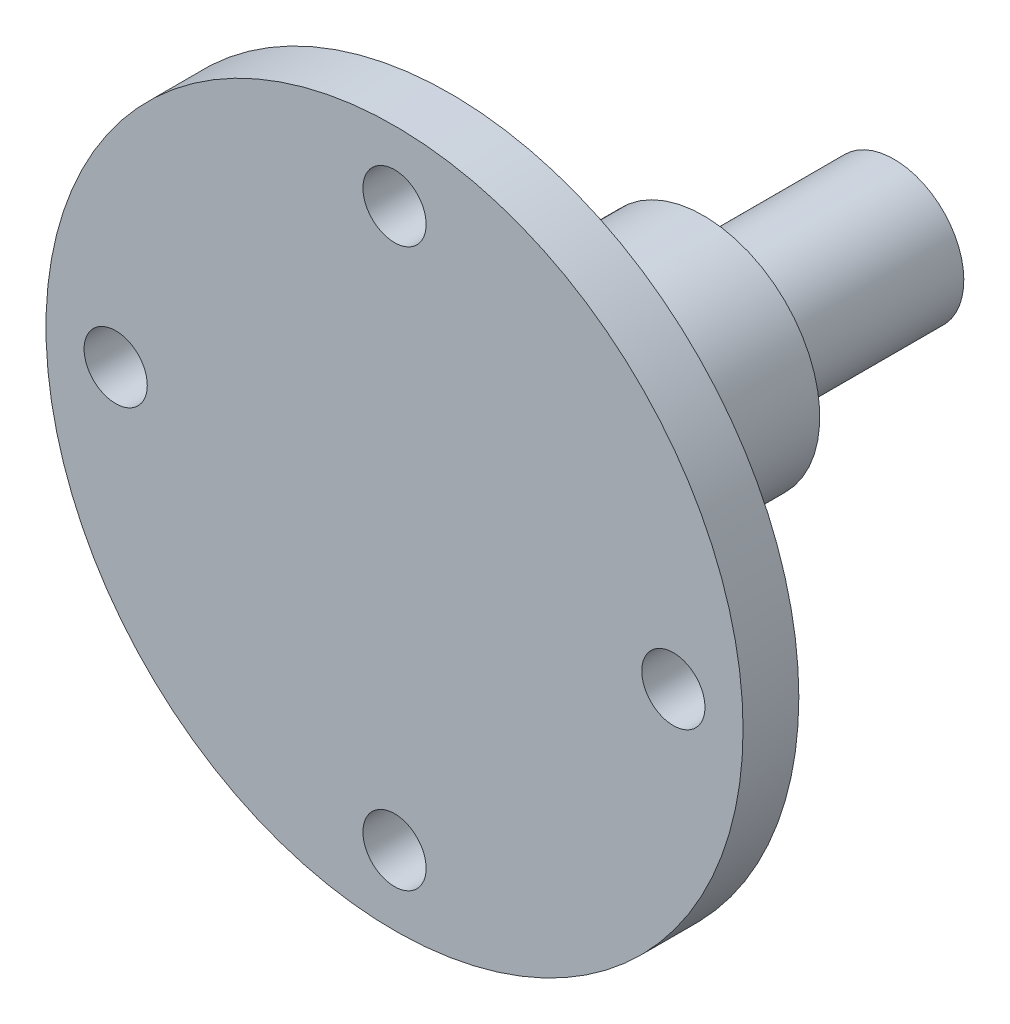
ISO-10303-21;
HEADER;
FILE_DESCRIPTION(('STEP AP214'),'2;1');
FILE_NAME('part.step','',(''),(''),'','','');
FILE_SCHEMA(('AUTOMOTIVE_DESIGN { 1 0 10303 214 1 1 1 1 }'));
ENDSEC;
DATA;
#1=APPLICATION_CONTEXT('core data for automotive mechanical design processes');
#2=APPLICATION_PROTOCOL_DEFINITION('international standard','automotive_design',2000,#1);
#3=PRODUCT_CONTEXT('',#1,'mechanical');
#4=PRODUCT('Part','Part','',(#3));
#5=PRODUCT_RELATED_PRODUCT_CATEGORY('part','',(#4));
#6=PRODUCT_DEFINITION_FORMATION('','',#4);
#7=PRODUCT_DEFINITION_CONTEXT('part definition',#1,'design');
#8=PRODUCT_DEFINITION('design','',#6,#7);
#9=PRODUCT_DEFINITION_SHAPE('','',#8);
#10=(LENGTH_UNIT() NAMED_UNIT(*) SI_UNIT(.MILLI.,.METRE.));
#11=(NAMED_UNIT(*) PLANE_ANGLE_UNIT() SI_UNIT($,.RADIAN.));
#12=(NAMED_UNIT(*) SI_UNIT($,.STERADIAN.) SOLID_ANGLE_UNIT());
#13=UNCERTAINTY_MEASURE_WITH_UNIT(LENGTH_MEASURE(1.E-05),#10,'distance_accuracy_value','');
#14=(GEOMETRIC_REPRESENTATION_CONTEXT(3) GLOBAL_UNCERTAINTY_ASSIGNED_CONTEXT((#13)) GLOBAL_UNIT_ASSIGNED_CONTEXT((#10,
#11,#12)) REPRESENTATION_CONTEXT('',''));
#15=CARTESIAN_POINT('',(0.,0.,0.));
#16=DIRECTION('',(0.,0.,1.));
#17=DIRECTION('',(1.,0.,0.));
#18=AXIS2_PLACEMENT_3D('',#15,#16,#17);
#19=CARTESIAN_POINT('',(0.,0.,6.));
#20=DIRECTION('',(0.,0.,-1.));
#21=DIRECTION('',(-1.,0.,0.));
#22=AXIS2_PLACEMENT_3D('',#19,#20,#21);
#23=CYLINDRICAL_SURFACE('',#22,37.5);
#24=CARTESIAN_POINT('',(0.,0.,6.));
#25=DIRECTION('',(0.,0.,1.));
#26=DIRECTION('',(1.,0.,0.));
#27=AXIS2_PLACEMENT_3D('',#24,#25,#26);
#28=CIRCLE('',#27,37.5);
#29=CARTESIAN_POINT('',(37.5,0.,6.));
#30=VERTEX_POINT('',#29);
#31=EDGE_CURVE('E153',#30,#30,#28,.T.);
#32=ORIENTED_EDGE('',*,*,#31,.F.);
#33=EDGE_LOOP('',(#32));
#34=FACE_BOUND('',#33,.T.);
#35=CARTESIAN_POINT('',(0.,0.,0.));
#36=DIRECTION('',(0.,0.,1.));
#37=DIRECTION('',(1.,0.,0.));
#38=AXIS2_PLACEMENT_3D('',#35,#36,#37);
#39=CIRCLE('',#38,37.5);
#40=CARTESIAN_POINT('',(37.5,0.,0.));
#41=VERTEX_POINT('',#40);
#42=EDGE_CURVE('E152',#41,#41,#39,.T.);
#43=ORIENTED_EDGE('',*,*,#42,.T.);
#44=EDGE_LOOP('',(#43));
#45=FACE_BOUND('',#44,.T.);
#46=ADVANCED_FACE('F34',(#34,#45),#23,.T.);
#47=CARTESIAN_POINT('',(0.,0.,6.));
#48=DIRECTION('',(0.,0.,1.));
#49=DIRECTION('',(1.,0.,0.));
#50=AXIS2_PLACEMENT_3D('',#47,#48,#49);
#51=PLANE('',#50);
#52=CARTESIAN_POINT('',(0.,30.,6.));
#53=DIRECTION('',(0.,0.,1.));
#54=DIRECTION('',(1.,0.,0.));
#55=AXIS2_PLACEMENT_3D('',#52,#53,#54);
#56=CIRCLE('',#55,3.4);
#57=CARTESIAN_POINT('',(3.4,30.,6.));
#58=VERTEX_POINT('',#57);
#59=EDGE_CURVE('E130',#58,#58,#56,.T.);
#60=ORIENTED_EDGE('',*,*,#59,.F.);
#61=EDGE_LOOP('',(#60));
#62=FACE_BOUND('',#61,.T.);
#63=CARTESIAN_POINT('',(30.,0.,6.));
#64=DIRECTION('',(0.,0.,1.));
#65=DIRECTION('',(1.,0.,0.));
#66=AXIS2_PLACEMENT_3D('',#63,#64,#65);
#67=CIRCLE('',#66,3.39999999999999);
#68=CARTESIAN_POINT('',(33.4,0.,6.));
#69=VERTEX_POINT('',#68);
#70=EDGE_CURVE('E136',#69,#69,#67,.T.);
#71=ORIENTED_EDGE('',*,*,#70,.F.);
#72=EDGE_LOOP('',(#71));
#73=FACE_BOUND('',#72,.T.);
#74=CARTESIAN_POINT('',(0.,-30.,6.));
#75=DIRECTION('',(0.,0.,1.));
#76=DIRECTION('',(1.,0.,0.));
#77=AXIS2_PLACEMENT_3D('',#74,#75,#76);
#78=CIRCLE('',#77,3.4);
#79=CARTESIAN_POINT('',(3.4,-30.,6.));
#80=VERTEX_POINT('',#79);
#81=EDGE_CURVE('E140',#80,#80,#78,.T.);
#82=ORIENTED_EDGE('',*,*,#81,.F.);
#83=EDGE_LOOP('',(#82));
#84=FACE_BOUND('',#83,.T.);
#85=CARTESIAN_POINT('',(-30.,0.,6.));
#86=DIRECTION('',(0.,0.,1.));
#87=DIRECTION('',(1.,0.,0.));
#88=AXIS2_PLACEMENT_3D('',#85,#86,#87);
#89=CIRCLE('',#88,3.4);
#90=CARTESIAN_POINT('',(-26.6,0.,6.));
#91=VERTEX_POINT('',#90);
#92=EDGE_CURVE('E146',#91,#91,#89,.T.);
#93=ORIENTED_EDGE('',*,*,#92,.F.);
#94=EDGE_LOOP('',(#93));
#95=FACE_BOUND('',#94,.T.);
#96=ORIENTED_EDGE('',*,*,#31,.T.);
#97=EDGE_LOOP('',(#96));
#98=FACE_BOUND('',#97,.T.);
#99=ADVANCED_FACE('F190',(#62,#73,#84,#95,#98),#51,.T.);
#100=CARTESIAN_POINT('',(0.,0.,0.));
#101=DIRECTION('',(0.,0.,1.));
#102=DIRECTION('',(1.,0.,0.));
#103=AXIS2_PLACEMENT_3D('',#100,#101,#102);
#104=PLANE('',#103);
#105=CARTESIAN_POINT('',(0.,0.,0.));
#106=DIRECTION('',(0.,0.,1.));
#107=DIRECTION('',(1.,0.,0.));
#108=AXIS2_PLACEMENT_3D('',#105,#106,#107);
#109=CIRCLE('',#108,14.5);
#110=CARTESIAN_POINT('',(14.5,0.,0.));
#111=VERTEX_POINT('',#110);
#112=EDGE_CURVE('E127',#111,#111,#109,.F.);
#113=ORIENTED_EDGE('',*,*,#112,.F.);
#114=EDGE_LOOP('',(#113));
#115=FACE_BOUND('',#114,.T.);
#116=CARTESIAN_POINT('',(0.,30.,0.));
#117=DIRECTION('',(0.,0.,1.));
#118=DIRECTION('',(1.,0.,0.));
#119=AXIS2_PLACEMENT_3D('',#116,#117,#118);
#120=CIRCLE('',#119,3.4);
#121=CARTESIAN_POINT('',(3.4,30.,0.));
#122=VERTEX_POINT('',#121);
#123=EDGE_CURVE('E133',#122,#122,#120,.T.);
#124=ORIENTED_EDGE('',*,*,#123,.T.);
#125=EDGE_LOOP('',(#124));
#126=FACE_BOUND('',#125,.T.);
#127=CARTESIAN_POINT('',(30.,0.,0.));
#128=DIRECTION('',(0.,0.,1.));
#129=DIRECTION('',(1.,0.,0.));
#130=AXIS2_PLACEMENT_3D('',#127,#128,#129);
#131=CIRCLE('',#130,3.39999999999999);
#132=CARTESIAN_POINT('',(33.4,0.,0.));
#133=VERTEX_POINT('',#132);
#134=EDGE_CURVE('E139',#133,#133,#131,.T.);
#135=ORIENTED_EDGE('',*,*,#134,.T.);
#136=EDGE_LOOP('',(#135));
#137=FACE_BOUND('',#136,.T.);
#138=CARTESIAN_POINT('',(0.,-30.,0.));
#139=DIRECTION('',(0.,0.,1.));
#140=DIRECTION('',(1.,0.,0.));
#141=AXIS2_PLACEMENT_3D('',#138,#139,#140);
#142=CIRCLE('',#141,3.4);
#143=CARTESIAN_POINT('',(3.4,-30.,0.));
#144=VERTEX_POINT('',#143);
#145=EDGE_CURVE('E143',#144,#144,#142,.T.);
#146=ORIENTED_EDGE('',*,*,#145,.T.);
#147=EDGE_LOOP('',(#146));
#148=FACE_BOUND('',#147,.T.);
#149=CARTESIAN_POINT('',(-30.,0.,0.));
#150=DIRECTION('',(0.,0.,1.));
#151=DIRECTION('',(1.,0.,0.));
#152=AXIS2_PLACEMENT_3D('',#149,#150,#151);
#153=CIRCLE('',#152,3.4);
#154=CARTESIAN_POINT('',(-26.6,0.,0.));
#155=VERTEX_POINT('',#154);
#156=EDGE_CURVE('E149',#155,#155,#153,.T.);
#157=ORIENTED_EDGE('',*,*,#156,.T.);
#158=EDGE_LOOP('',(#157));
#159=FACE_BOUND('',#158,.T.);
#160=ORIENTED_EDGE('',*,*,#42,.F.);
#161=EDGE_LOOP('',(#160));
#162=FACE_BOUND('',#161,.T.);
#163=ADVANCED_FACE('F195',(#115,#126,#137,#148,#159,#162),#104,.F.);
#164=CARTESIAN_POINT('',(-30.,0.,6.));
#165=DIRECTION('',(0.,0.,1.));
#166=DIRECTION('',(1.,0.,0.));
#167=AXIS2_PLACEMENT_3D('',#164,#165,#166);
#168=CYLINDRICAL_SURFACE('',#167,3.4);
#169=ORIENTED_EDGE('',*,*,#92,.T.);
#170=EDGE_LOOP('',(#169));
#171=FACE_BOUND('',#170,.T.);
#172=ORIENTED_EDGE('',*,*,#156,.F.);
#173=EDGE_LOOP('',(#172));
#174=FACE_BOUND('',#173,.T.);
#175=ADVANCED_FACE('F203',(#171,#174),#168,.F.);
#176=CARTESIAN_POINT('',(0.,-30.,6.));
#177=DIRECTION('',(0.,0.,1.));
#178=DIRECTION('',(1.,0.,0.));
#179=AXIS2_PLACEMENT_3D('',#176,#177,#178);
#180=CYLINDRICAL_SURFACE('',#179,3.4);
#181=ORIENTED_EDGE('',*,*,#81,.T.);
#182=EDGE_LOOP('',(#181));
#183=FACE_BOUND('',#182,.T.);
#184=ORIENTED_EDGE('',*,*,#145,.F.);
#185=EDGE_LOOP('',(#184));
#186=FACE_BOUND('',#185,.T.);
#187=ADVANCED_FACE('F208',(#183,#186),#180,.F.);
#188=CARTESIAN_POINT('',(30.,0.,6.));
#189=DIRECTION('',(0.,0.,1.));
#190=DIRECTION('',(1.,0.,0.));
#191=AXIS2_PLACEMENT_3D('',#188,#189,#190);
#192=CYLINDRICAL_SURFACE('',#191,3.39999999999999);
#193=ORIENTED_EDGE('',*,*,#70,.T.);
#194=EDGE_LOOP('',(#193));
#195=FACE_BOUND('',#194,.T.);
#196=ORIENTED_EDGE('',*,*,#134,.F.);
#197=EDGE_LOOP('',(#196));
#198=FACE_BOUND('',#197,.T.);
#199=ADVANCED_FACE('F216',(#195,#198),#192,.F.);
#200=CARTESIAN_POINT('',(0.,30.,6.));
#201=DIRECTION('',(0.,0.,1.));
#202=DIRECTION('',(1.,0.,0.));
#203=AXIS2_PLACEMENT_3D('',#200,#201,#202);
#204=CYLINDRICAL_SURFACE('',#203,3.4);
#205=ORIENTED_EDGE('',*,*,#59,.T.);
#206=EDGE_LOOP('',(#205));
#207=FACE_BOUND('',#206,.T.);
#208=ORIENTED_EDGE('',*,*,#123,.F.);
#209=EDGE_LOOP('',(#208));
#210=FACE_BOUND('',#209,.T.);
#211=ADVANCED_FACE('F220',(#207,#210),#204,.F.);
#212=CARTESIAN_POINT('',(0.,0.,-6.));
#213=DIRECTION('',(0.,0.,1.));
#214=DIRECTION('',(1.,0.,0.));
#215=AXIS2_PLACEMENT_3D('',#212,#213,#214);
#216=CYLINDRICAL_SURFACE('',#215,14.5);
#217=CARTESIAN_POINT('',(0.,0.,-6.));
#218=DIRECTION('',(0.,0.,-1.));
#219=DIRECTION('',(-1.,0.,0.));
#220=AXIS2_PLACEMENT_3D('',#217,#218,#219);
#221=CIRCLE('',#220,14.5);
#222=CARTESIAN_POINT('',(-14.5,0.,-6.));
#223=VERTEX_POINT('',#222);
#224=EDGE_CURVE('E124',#223,#223,#221,.T.);
#225=ORIENTED_EDGE('',*,*,#224,.F.);
#226=EDGE_LOOP('',(#225));
#227=FACE_BOUND('',#226,.T.);
#228=ORIENTED_EDGE('',*,*,#112,.T.);
#229=EDGE_LOOP('',(#228));
#230=FACE_BOUND('',#229,.T.);
#231=ADVANCED_FACE('F224',(#227,#230),#216,.T.);
#232=CARTESIAN_POINT('',(0.,0.,-6.));
#233=DIRECTION('',(0.,0.,-1.));
#234=DIRECTION('',(-1.,0.,0.));
#235=AXIS2_PLACEMENT_3D('',#232,#233,#234);
#236=PLANE('',#235);
#237=CARTESIAN_POINT('',(0.,0.,-6.));
#238=DIRECTION('',(0.,0.,-1.));
#239=DIRECTION('',(-1.,0.,0.));
#240=AXIS2_PLACEMENT_3D('',#237,#238,#239);
#241=CIRCLE('',#240,12.5);
#242=CARTESIAN_POINT('',(-12.5,0.,-6.));
#243=VERTEX_POINT('',#242);
#244=EDGE_CURVE('E121',#243,#243,#241,.T.);
#245=ORIENTED_EDGE('',*,*,#244,.F.);
#246=EDGE_LOOP('',(#245));
#247=FACE_BOUND('',#246,.T.);
#248=ORIENTED_EDGE('',*,*,#224,.T.);
#249=EDGE_LOOP('',(#248));
#250=FACE_BOUND('',#249,.T.);
#251=ADVANCED_FACE('F228',(#247,#250),#236,.T.);
#252=CARTESIAN_POINT('',(0.,0.,-27.25));
#253=DIRECTION('',(0.,0.,1.));
#254=DIRECTION('',(1.,0.,0.));
#255=AXIS2_PLACEMENT_3D('',#252,#253,#254);
#256=CYLINDRICAL_SURFACE('',#255,12.5);
#257=CARTESIAN_POINT('',(0.,0.,-27.25));
#258=DIRECTION('',(0.,0.,-1.));
#259=DIRECTION('',(-1.,0.,0.));
#260=AXIS2_PLACEMENT_3D('',#257,#258,#259);
#261=CIRCLE('',#260,12.5);
#262=CARTESIAN_POINT('',(-12.5,0.,-27.25));
#263=VERTEX_POINT('',#262);
#264=EDGE_CURVE('E116',#263,#263,#261,.T.);
#265=ORIENTED_EDGE('',*,*,#264,.F.);
#266=EDGE_LOOP('',(#265));
#267=FACE_BOUND('',#266,.T.);
#268=ORIENTED_EDGE('',*,*,#244,.T.);
#269=EDGE_LOOP('',(#268));
#270=FACE_BOUND('',#269,.T.);
#271=ADVANCED_FACE('F232',(#267,#270),#256,.T.);
#272=CARTESIAN_POINT('',(0.,0.,-27.25));
#273=DIRECTION('',(0.,0.,-1.));
#274=DIRECTION('',(-1.,0.,0.));
#275=AXIS2_PLACEMENT_3D('',#272,#273,#274);
#276=PLANE('',#275);
#277=CARTESIAN_POINT('',(0.,0.,-27.25));
#278=DIRECTION('',(0.,0.,-1.));
#279=DIRECTION('',(-1.,0.,0.));
#280=AXIS2_PLACEMENT_3D('',#277,#278,#279);
#281=CIRCLE('',#280,7.5);
#282=CARTESIAN_POINT('',(-7.5,0.,-27.25));
#283=VERTEX_POINT('',#282);
#284=EDGE_CURVE('E117',#283,#283,#281,.T.);
#285=ORIENTED_EDGE('',*,*,#284,.F.);
#286=EDGE_LOOP('',(#285));
#287=FACE_BOUND('',#286,.T.);
#288=ORIENTED_EDGE('',*,*,#264,.T.);
#289=EDGE_LOOP('',(#288));
#290=FACE_BOUND('',#289,.T.);
#291=ADVANCED_FACE('F236',(#287,#290),#276,.T.);
#292=CARTESIAN_POINT('',(0.,0.,-47.75));
#293=DIRECTION('',(0.,0.,1.));
#294=DIRECTION('',(1.,0.,0.));
#295=AXIS2_PLACEMENT_3D('',#292,#293,#294);
#296=CYLINDRICAL_SURFACE('',#295,7.5);
#297=CARTESIAN_POINT('',(-2.5,-7.07106781186548,-30.75));
#298=CARTESIAN_POINT('',(-2.50000899110405,-7.07105693273157,-30.6817929221797));
#299=CARTESIAN_POINT('',(-2.49720887221585,-7.07205443904569,-30.6135919253246));
#300=CARTESIAN_POINT('',(-2.4860604578047,-7.07598524121007,-30.4777189616507));
#301=CARTESIAN_POINT('',(-2.47771365997202,-7.07891801450643,-30.4100468570119));
#302=CARTESIAN_POINT('',(-2.45557459422795,-7.08662705252507,-30.2759095116454));
#303=CARTESIAN_POINT('',(-2.44179847763135,-7.09139784850118,-30.2094412974491));
#304=CARTESIAN_POINT('',(-2.4089418103012,-7.10262619906002,-30.0779917314172));
#305=CARTESIAN_POINT('',(-2.38986106786032,-7.10908381460331,-30.0130104334101));
#306=CARTESIAN_POINT('',(-2.32491551306196,-7.13069940793912,-29.8210384202854));
#307=CARTESIAN_POINT('',(-2.2713141681025,-7.14811243884051,-29.69682084253));
#308=CARTESIAN_POINT('',(-2.14517784106254,-7.1869703408752,-29.4591231885366));
#309=CARTESIAN_POINT('',(-2.07263123268531,-7.20841768551077,-29.3456497642198));
#310=CARTESIAN_POINT('',(-1.90762995846818,-7.25386182389479,-29.1282070965292));
#311=CARTESIAN_POINT('',(-1.81456284630833,-7.27792189428067,-29.0247148572318));
#312=CARTESIAN_POINT('',(-1.61247071190512,-7.32534626726038,-28.8344828967663));
#313=CARTESIAN_POINT('',(-1.50344285413658,-7.34871044533518,-28.747746158681));
#314=CARTESIAN_POINT('',(-1.26900922493972,-7.39284706096344,-28.5913017757375));
#315=CARTESIAN_POINT('',(-1.14325025284461,-7.41353593532888,-28.5220976922578));
#316=CARTESIAN_POINT('',(-0.881073095475286,-7.44924021883279,-28.4060192175653));
#317=CARTESIAN_POINT('',(-0.74465818122588,-7.46425736081204,-28.3591380050743));
#318=CARTESIAN_POINT('',(-0.470073371182905,-7.48647677762783,-28.2906607237417));
#319=CARTESIAN_POINT('',(-0.33212958815374,-7.49393272446142,-28.2682418290428));
#320=CARTESIAN_POINT('',(-0.0542474216361969,-7.50109021034827,-28.2467092432615));
#321=CARTESIAN_POINT('',(0.0856904786402184,-7.50079359709905,-28.2475899990842));
#322=CARTESIAN_POINT('',(0.357759612692406,-7.49265096581776,-28.2721107104005));
#323=CARTESIAN_POINT('',(0.489981756428175,-7.48510152476447,-28.2948565956047));
#324=CARTESIAN_POINT('',(0.748610161077315,-7.46367401253772,-28.3609829959792));
#325=CARTESIAN_POINT('',(0.87501609907774,-7.44979559044789,-28.4043646553253));
#326=CARTESIAN_POINT('',(1.12038155754035,-7.41689170677793,-28.5110534241944));
#327=CARTESIAN_POINT('',(1.23922126412503,-7.39780094595656,-28.5746151128576));
#328=CARTESIAN_POINT('',(1.46481147275367,-7.35645969200236,-28.719649878425));
#329=CARTESIAN_POINT('',(1.57155867428944,-7.33420833994017,-28.8011278276021));
#330=CARTESIAN_POINT('',(1.77524334927518,-7.28765679856813,-28.9841776250069));
#331=CARTESIAN_POINT('',(1.87148402903098,-7.26330946699776,-29.0865138590282));
#332=CARTESIAN_POINT('',(2.04568006205173,-7.21618726182137,-29.3061037242864));
#333=CARTESIAN_POINT('',(2.12362950795974,-7.19341289789385,-29.423362156007));
#334=CARTESIAN_POINT('',(2.26000831398175,-7.15175078440791,-29.6717004458843));
#335=CARTESIAN_POINT('',(2.31813252376915,-7.13292537370586,-29.8029587873326));
#336=CARTESIAN_POINT('',(2.41115057675285,-7.10202742655098,-30.0741174439746));
#337=CARTESIAN_POINT('',(2.4460810901384,-7.08994423522482,-30.2140037334303));
#338=CARTESIAN_POINT('',(2.47914539070207,-7.078413552368,-30.42104659187));
#339=CARTESIAN_POINT('',(2.48696265313779,-7.07566669236505,-30.4866034746356));
#340=CARTESIAN_POINT('',(2.497386540178,-7.07199258928497,-30.6180951959995));
#341=CARTESIAN_POINT('',(2.49999988848745,-7.0710629982382,-30.684029436361));
#342=CARTESIAN_POINT('',(2.5,-7.07106781186547,-30.75));
#343=B_SPLINE_CURVE_WITH_KNOTS('',3,(#297,#298,#299,#300,#301,#302,#303,#304,#305,#306,#307,
#308,#309,#310,#311,#312,#313,#314,#315,#316,#317,#318,#319,#320,#321,#322,#323,#324,#325,#326,
#327,#328,#329,#330,#331,#332,#333,#334,#335,#336,#337,#338,#339,#340,#341,#342),.UNSPECIFIED.,
.F.,.F.,(4,2,2,2,2,2,2,2,2,2,2,2,2,2,2,2,2,2,2,2,2,2,4),(0.,0.204546211838584,0.409037215423656,
0.612924429429078,0.816819012805388,1.22401016923255,1.63145179965523,2.05327864088389,
2.47518051341064,2.90809434014449,3.34087579484514,3.75860278500203,4.17623021758301,
4.57747647846033,4.97874498952315,5.38529148746615,5.79194868153617,6.21771736826821,
6.64362337304802,7.07581676501795,7.50732520398793,7.70536340013574,7.90314555504337),.UNSPECIFIED.);
#344=CARTESIAN_POINT('',(-2.5,-7.07106781186547,-30.75));
#345=VERTEX_POINT('',#344);
#346=CARTESIAN_POINT('',(2.5,-7.07106781186547,-30.75));
#347=VERTEX_POINT('',#346);
#348=EDGE_CURVE('E11',#345,#347,#343,.T.);
#349=ORIENTED_EDGE('',*,*,#348,.T.);
#350=DIRECTION('',(0.,0.,1.));
#351=VECTOR('',#350,1.);
#352=CARTESIAN_POINT('',(2.5,-7.07106781186548,-47.75));
#353=LINE('',#352,#351);
#354=CARTESIAN_POINT('',(2.5,-7.07106781186547,-47.75));
#355=VERTEX_POINT('',#354);
#356=EDGE_CURVE('E104',#347,#355,#353,.F.);
#357=ORIENTED_EDGE('',*,*,#356,.T.);
#358=CARTESIAN_POINT('',(0.,0.,-47.75));
#359=DIRECTION('',(0.,0.,-1.));
#360=DIRECTION('',(-1.,0.,0.));
#361=AXIS2_PLACEMENT_3D('',#358,#359,#360);
#362=CIRCLE('',#361,7.5);
#363=CARTESIAN_POINT('',(-2.5,-7.07106781186547,-47.75));
#364=VERTEX_POINT('',#363);
#365=EDGE_CURVE('E113',#364,#355,#362,.T.);
#366=ORIENTED_EDGE('',*,*,#365,.F.);
#367=DIRECTION('',(0.,0.,1.));
#368=VECTOR('',#367,1.);
#369=CARTESIAN_POINT('',(-2.5,-7.07106781186548,-47.75));
#370=LINE('',#369,#368);
#371=EDGE_CURVE('E101',#364,#345,#370,.T.);
#372=ORIENTED_EDGE('',*,*,#371,.T.);
#373=EDGE_LOOP('',(#349,#357,#366,#372));
#374=FACE_BOUND('',#373,.T.);
#375=ORIENTED_EDGE('',*,*,#284,.T.);
#376=EDGE_LOOP('',(#375));
#377=FACE_BOUND('',#376,.T.);
#378=ADVANCED_FACE('F169',(#374,#377),#296,.T.);
#379=CARTESIAN_POINT('',(0.,0.,-47.75));
#380=DIRECTION('',(0.,0.,-1.));
#381=DIRECTION('',(-1.,0.,0.));
#382=AXIS2_PLACEMENT_3D('',#379,#380,#381);
#383=PLANE('',#382);
#384=DIRECTION('',(0.,-1.,0.));
#385=VECTOR('',#384,1.);
#386=CARTESIAN_POINT('',(2.5,0.,-47.75));
#387=LINE('',#386,#385);
#388=CARTESIAN_POINT('',(2.5,-4.5,-47.75));
#389=VERTEX_POINT('',#388);
#390=EDGE_CURVE('E47',#389,#355,#387,.T.);
#391=ORIENTED_EDGE('',*,*,#390,.F.);
#392=DIRECTION('',(1.,0.,0.));
#393=VECTOR('',#392,1.);
#394=CARTESIAN_POINT('',(0.,-4.5,-47.75));
#395=LINE('',#394,#393);
#396=CARTESIAN_POINT('',(-2.5,-4.5,-47.75));
#397=VERTEX_POINT('',#396);
#398=EDGE_CURVE('E120',#397,#389,#395,.T.);
#399=ORIENTED_EDGE('',*,*,#398,.F.);
#400=DIRECTION('',(0.,1.,0.));
#401=VECTOR('',#400,1.);
#402=CARTESIAN_POINT('',(-2.5,0.,-47.75));
#403=LINE('',#402,#401);
#404=EDGE_CURVE('E96',#364,#397,#403,.T.);
#405=ORIENTED_EDGE('',*,*,#404,.F.);
#406=ORIENTED_EDGE('',*,*,#365,.T.);
#407=EDGE_LOOP('',(#391,#399,#405,#406));
#408=FACE_BOUND('',#407,.T.);
#409=CARTESIAN_POINT('',(0.,0.,-47.75));
#410=DIRECTION('',(0.,0.,-1.));
#411=DIRECTION('',(-1.,0.,0.));
#412=AXIS2_PLACEMENT_3D('',#409,#410,#411);
#413=CIRCLE('',#412,2.5);
#414=CARTESIAN_POINT('',(-2.5,0.,-47.75));
#415=VERTEX_POINT('',#414);
#416=EDGE_CURVE('E107',#415,#415,#413,.T.);
#417=ORIENTED_EDGE('',*,*,#416,.F.);
#418=EDGE_LOOP('',(#417));
#419=FACE_BOUND('',#418,.T.);
#420=ADVANCED_FACE('F171',(#408,#419),#383,.T.);
#421=CARTESIAN_POINT('',(0.,0.,-23.75));
#422=DIRECTION('',(0.,0.,-1.));
#423=DIRECTION('',(-1.,0.,0.));
#424=AXIS2_PLACEMENT_3D('',#421,#422,#423);
#425=CONICAL_SURFACE('',#424,2.5,1.02974425867665);
#426=CARTESIAN_POINT('',(0.,0.,-22.2478484524311));
#427=VERTEX_POINT('',#426);
#428=VERTEX_LOOP('',#427);
#429=FACE_BOUND('',#428,.T.);
#430=CARTESIAN_POINT('',(0.,0.,-23.75));
#431=DIRECTION('',(0.,0.,-1.));
#432=DIRECTION('',(-1.,0.,0.));
#433=AXIS2_PLACEMENT_3D('',#430,#431,#432);
#434=CIRCLE('',#433,2.5);
#435=CARTESIAN_POINT('',(-2.5,0.,-23.75));
#436=VERTEX_POINT('',#435);
#437=EDGE_CURVE('E110',#436,#436,#434,.T.);
#438=ORIENTED_EDGE('',*,*,#437,.T.);
#439=EDGE_LOOP('',(#438));
#440=FACE_BOUND('',#439,.T.);
#441=ADVANCED_FACE('F174',(#429,#440),#425,.F.);
#442=CARTESIAN_POINT('',(0.,0.,-47.75));
#443=DIRECTION('',(0.,0.,-1.));
#444=DIRECTION('',(-1.,0.,0.));
#445=AXIS2_PLACEMENT_3D('',#442,#443,#444);
#446=CYLINDRICAL_SURFACE('',#445,2.5);
#447=ORIENTED_EDGE('',*,*,#437,.F.);
#448=EDGE_LOOP('',(#447));
#449=FACE_BOUND('',#448,.T.);
#450=ORIENTED_EDGE('',*,*,#416,.T.);
#451=EDGE_LOOP('',(#450));
#452=FACE_BOUND('',#451,.T.);
#453=ADVANCED_FACE('F178',(#449,#452),#446,.F.);
#454=CARTESIAN_POINT('',(0.,-37.5,-30.75));
#455=DIRECTION('',(0.,1.,0.));
#456=DIRECTION('',(0.,0.,1.));
#457=AXIS2_PLACEMENT_3D('',#454,#455,#456);
#458=CYLINDRICAL_SURFACE('',#457,2.5);
#459=DIRECTION('',(0.,1.,0.));
#460=VECTOR('',#459,1.);
#461=CARTESIAN_POINT('',(-2.5,-37.5,-30.75));
#462=LINE('',#461,#460);
#463=CARTESIAN_POINT('',(-2.5,-4.5,-30.75));
#464=VERTEX_POINT('',#463);
#465=EDGE_CURVE('E81',#345,#464,#462,.T.);
#466=ORIENTED_EDGE('',*,*,#465,.T.);
#467=CARTESIAN_POINT('',(0.,-4.5,-30.75));
#468=DIRECTION('',(0.,1.,0.));
#469=DIRECTION('',(0.,0.,1.));
#470=AXIS2_PLACEMENT_3D('',#467,#468,#469);
#471=CIRCLE('',#470,2.5);
#472=CARTESIAN_POINT('',(2.5,-4.5,-30.75));
#473=VERTEX_POINT('',#472);
#474=EDGE_CURVE('E84',#464,#473,#471,.T.);
#475=ORIENTED_EDGE('',*,*,#474,.T.);
#476=DIRECTION('',(0.,1.,0.));
#477=VECTOR('',#476,1.);
#478=CARTESIAN_POINT('',(2.5,-37.5,-30.75));
#479=LINE('',#478,#477);
#480=EDGE_CURVE('E88',#347,#473,#479,.T.);
#481=ORIENTED_EDGE('',*,*,#480,.F.);
#482=ORIENTED_EDGE('',*,*,#348,.F.);
#483=EDGE_LOOP('',(#466,#475,#481,#482));
#484=FACE_BOUND('',#483,.T.);
#485=ADVANCED_FACE('F82',(#484),#458,.F.);
#486=CARTESIAN_POINT('',(2.5,-37.5,-47.75));
#487=DIRECTION('',(1.,0.,0.));
#488=DIRECTION('',(0.,0.,-1.));
#489=AXIS2_PLACEMENT_3D('',#486,#487,#488);
#490=PLANE('',#489);
#491=ORIENTED_EDGE('',*,*,#480,.T.);
#492=DIRECTION('',(0.,0.,-1.));
#493=VECTOR('',#492,1.);
#494=CARTESIAN_POINT('',(2.5,-4.5,-47.75));
#495=LINE('',#494,#493);
#496=EDGE_CURVE('E89',#473,#389,#495,.T.);
#497=ORIENTED_EDGE('',*,*,#496,.T.);
#498=ORIENTED_EDGE('',*,*,#390,.T.);
#499=ORIENTED_EDGE('',*,*,#356,.F.);
#500=EDGE_LOOP('',(#491,#497,#498,#499));
#501=FACE_BOUND('',#500,.T.);
#502=ADVANCED_FACE('F165',(#501),#490,.F.);
#503=CARTESIAN_POINT('',(-2.5,-37.5,-47.75));
#504=DIRECTION('',(-1.,0.,0.));
#505=DIRECTION('',(0.,0.,1.));
#506=AXIS2_PLACEMENT_3D('',#503,#504,#505);
#507=PLANE('',#506);
#508=ORIENTED_EDGE('',*,*,#404,.T.);
#509=DIRECTION('',(0.,0.,1.));
#510=VECTOR('',#509,1.);
#511=CARTESIAN_POINT('',(-2.5,-4.5,-47.75));
#512=LINE('',#511,#510);
#513=EDGE_CURVE('E54',#397,#464,#512,.T.);
#514=ORIENTED_EDGE('',*,*,#513,.T.);
#515=ORIENTED_EDGE('',*,*,#465,.F.);
#516=ORIENTED_EDGE('',*,*,#371,.F.);
#517=EDGE_LOOP('',(#508,#514,#515,#516));
#518=FACE_BOUND('',#517,.T.);
#519=ADVANCED_FACE('F94',(#518),#507,.F.);
#520=CARTESIAN_POINT('',(0.,-4.5,-47.75));
#521=DIRECTION('',(0.,1.,0.));
#522=DIRECTION('',(0.,0.,1.));
#523=AXIS2_PLACEMENT_3D('',#520,#521,#522);
#524=PLANE('',#523);
#525=ORIENTED_EDGE('',*,*,#398,.T.);
#526=ORIENTED_EDGE('',*,*,#496,.F.);
#527=ORIENTED_EDGE('',*,*,#474,.F.);
#528=ORIENTED_EDGE('',*,*,#513,.F.);
#529=EDGE_LOOP('',(#525,#526,#527,#528));
#530=FACE_BOUND('',#529,.T.);
#531=ADVANCED_FACE('F91',(#530),#524,.F.);
#532=CLOSED_SHELL('',(#46,#99,#163,#175,#187,#199,#211,#231,#251,#271,#291,#378,#420,#441,#453,
#485,#502,#519,#531));
#533=MANIFOLD_SOLID_BREP('B2',#532);
#534=ADVANCED_BREP_SHAPE_REPRESENTATION('',(#18,#533),#14);
#535=SHAPE_DEFINITION_REPRESENTATION(#9,#534);
ENDSEC;
END-ISO-10303-21;
